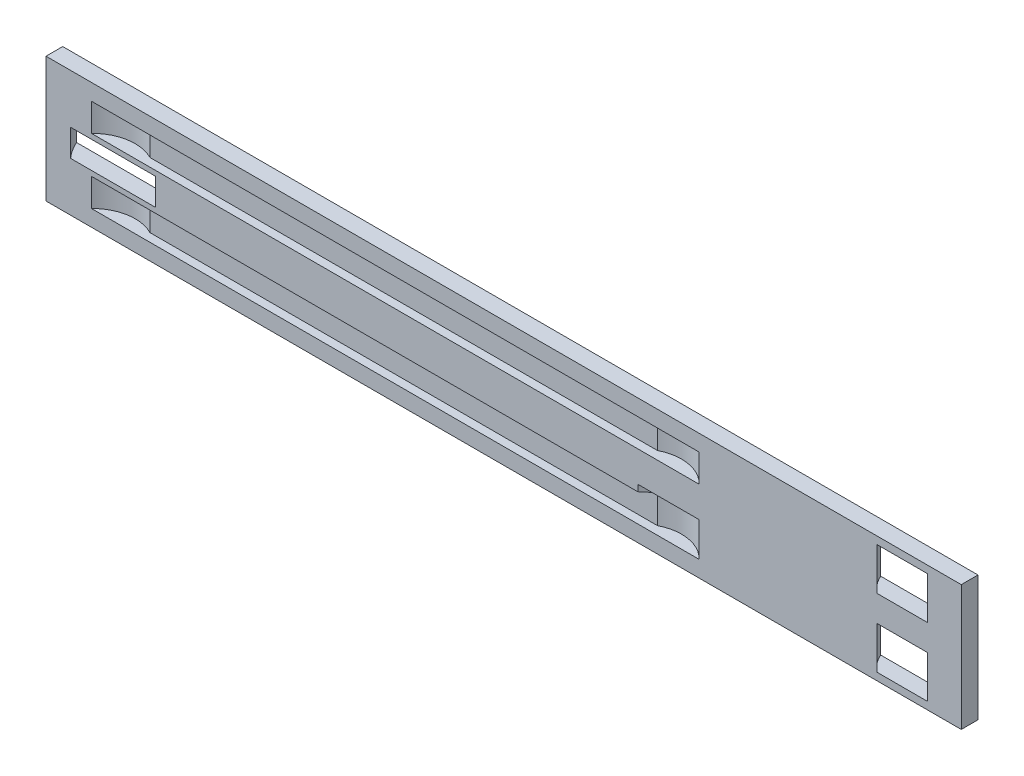
ISO-10303-21;
HEADER;
FILE_DESCRIPTION(('STEP AP214'),'2;1');
FILE_NAME('part.step','',(''),(''),'','','');
FILE_SCHEMA(('AUTOMOTIVE_DESIGN { 1 0 10303 214 1 1 1 1 }'));
ENDSEC;
DATA;
#1=APPLICATION_CONTEXT('core data for automotive mechanical design processes');
#2=APPLICATION_PROTOCOL_DEFINITION('international standard','automotive_design',2000,#1);
#3=PRODUCT_CONTEXT('',#1,'mechanical');
#4=PRODUCT('Part','Part','',(#3));
#5=PRODUCT_RELATED_PRODUCT_CATEGORY('part','',(#4));
#6=PRODUCT_DEFINITION_FORMATION('','',#4);
#7=PRODUCT_DEFINITION_CONTEXT('part definition',#1,'design');
#8=PRODUCT_DEFINITION('design','',#6,#7);
#9=PRODUCT_DEFINITION_SHAPE('','',#8);
#10=(LENGTH_UNIT() NAMED_UNIT(*) SI_UNIT(.MILLI.,.METRE.));
#11=(NAMED_UNIT(*) PLANE_ANGLE_UNIT() SI_UNIT($,.RADIAN.));
#12=(NAMED_UNIT(*) SI_UNIT($,.STERADIAN.) SOLID_ANGLE_UNIT());
#13=UNCERTAINTY_MEASURE_WITH_UNIT(LENGTH_MEASURE(1.E-05),#10,'distance_accuracy_value','');
#14=(GEOMETRIC_REPRESENTATION_CONTEXT(3) GLOBAL_UNCERTAINTY_ASSIGNED_CONTEXT((#13)) GLOBAL_UNIT_ASSIGNED_CONTEXT((#10,
#11,#12)) REPRESENTATION_CONTEXT('',''));
#15=CARTESIAN_POINT('',(0.,0.,0.));
#16=DIRECTION('',(0.,0.,1.));
#17=DIRECTION('',(1.,0.,0.));
#18=AXIS2_PLACEMENT_3D('',#15,#16,#17);
#19=CARTESIAN_POINT('',(0.,0.,18.));
#20=DIRECTION('',(0.,0.,-1.));
#21=DIRECTION('',(-1.,0.,0.));
#22=AXIS2_PLACEMENT_3D('',#19,#20,#21);
#23=PLANE('',#22);
#24=DIRECTION('',(-1.,0.,0.));
#25=VECTOR('',#24,1.);
#26=CARTESIAN_POINT('',(0.,54.5,18.));
#27=LINE('',#26,#25);
#28=CARTESIAN_POINT('',(702.954576716283,54.5000000000002,18.));
#29=VERTEX_POINT('',#28);
#30=CARTESIAN_POINT('',(636.86373014885,54.5000000000002,18.));
#31=VERTEX_POINT('',#30);
#32=EDGE_CURVE('E11',#29,#31,#27,.T.);
#33=ORIENTED_EDGE('',*,*,#32,.F.);
#34=DIRECTION('',(0.,-1.,0.));
#35=VECTOR('',#34,1.);
#36=CARTESIAN_POINT('',(702.954576716283,47.5000000000002,18.));
#37=LINE('',#36,#35);
#38=CARTESIAN_POINT('',(702.954576716283,17.5000000000002,18.));
#39=VERTEX_POINT('',#38);
#40=EDGE_CURVE('E214',#29,#39,#37,.T.);
#41=ORIENTED_EDGE('',*,*,#40,.T.);
#42=DIRECTION('',(1.,0.,0.));
#43=VECTOR('',#42,1.);
#44=CARTESIAN_POINT('',(48.9545767162834,17.5,18.));
#45=LINE('',#44,#43);
#46=CARTESIAN_POINT('',(48.9545767162834,17.5,18.));
#47=VERTEX_POINT('',#46);
#48=EDGE_CURVE('E227',#47,#39,#45,.T.);
#49=ORIENTED_EDGE('',*,*,#48,.F.);
#50=DIRECTION('',(0.,-1.,0.));
#51=VECTOR('',#50,1.);
#52=CARTESIAN_POINT('',(48.9545767162834,47.5,18.));
#53=LINE('',#52,#51);
#54=CARTESIAN_POINT('',(48.9545767162834,47.5,18.));
#55=VERTEX_POINT('',#54);
#56=EDGE_CURVE('E63',#55,#47,#53,.T.);
#57=ORIENTED_EDGE('',*,*,#56,.F.);
#58=DIRECTION('',(1.,0.,0.));
#59=VECTOR('',#58,1.);
#60=CARTESIAN_POINT('',(48.9545767162834,47.5,18.));
#61=LINE('',#60,#59);
#62=CARTESIAN_POINT('',(636.86373014885,47.5000000000002,18.));
#63=VERTEX_POINT('',#62);
#64=EDGE_CURVE('E221',#55,#63,#61,.T.);
#65=ORIENTED_EDGE('',*,*,#64,.T.);
#66=DIRECTION('',(0.,-1.,0.));
#67=VECTOR('',#66,1.);
#68=CARTESIAN_POINT('',(636.86373014885,54.5000000000002,18.));
#69=LINE('',#68,#67);
#70=EDGE_CURVE('E55',#63,#31,#69,.F.);
#71=ORIENTED_EDGE('',*,*,#70,.T.);
#72=EDGE_LOOP('',(#33,#41,#49,#57,#65,#71));
#73=FACE_BOUND('',#72,.T.);
#74=DIRECTION('',(0.,1.,0.));
#75=VECTOR('',#74,1.);
#76=CARTESIAN_POINT('',(702.954576716283,87.5000000000002,18.));
#77=LINE('',#76,#75);
#78=CARTESIAN_POINT('',(702.954576716283,87.5000000000002,18.));
#79=VERTEX_POINT('',#78);
#80=CARTESIAN_POINT('',(702.954576716283,117.5,18.));
#81=VERTEX_POINT('',#80);
#82=EDGE_CURVE('E291',#79,#81,#77,.T.);
#83=ORIENTED_EDGE('',*,*,#82,.F.);
#84=DIRECTION('',(1.,0.,0.));
#85=VECTOR('',#84,1.);
#86=CARTESIAN_POINT('',(48.9545767162833,87.5,18.));
#87=LINE('',#86,#85);
#88=CARTESIAN_POINT('',(48.9545767162833,87.5,18.));
#89=VERTEX_POINT('',#88);
#90=EDGE_CURVE('E273',#89,#79,#87,.T.);
#91=ORIENTED_EDGE('',*,*,#90,.F.);
#92=DIRECTION('',(0.,1.,0.));
#93=VECTOR('',#92,1.);
#94=CARTESIAN_POINT('',(48.9545767162833,87.5,18.));
#95=LINE('',#94,#93);
#96=CARTESIAN_POINT('',(48.9545767162833,117.5,18.));
#97=VERTEX_POINT('',#96);
#98=EDGE_CURVE('E296',#89,#97,#95,.T.);
#99=ORIENTED_EDGE('',*,*,#98,.T.);
#100=DIRECTION('',(1.,0.,0.));
#101=VECTOR('',#100,1.);
#102=CARTESIAN_POINT('',(48.9545767162833,117.5,18.));
#103=LINE('',#102,#101);
#104=EDGE_CURVE('E265',#97,#81,#103,.T.);
#105=ORIENTED_EDGE('',*,*,#104,.T.);
#106=EDGE_LOOP('',(#83,#91,#99,#105));
#107=FACE_BOUND('',#106,.T.);
#108=DIRECTION('',(1.,0.,0.));
#109=VECTOR('',#108,1.);
#110=CARTESIAN_POINT('',(0.,81.5,18.));
#111=LINE('',#110,#109);
#112=CARTESIAN_POINT('',(894.5,81.5000000000004,18.));
#113=VERTEX_POINT('',#112);
#114=CARTESIAN_POINT('',(948.5,81.5000000000004,18.));
#115=VERTEX_POINT('',#114);
#116=EDGE_CURVE('E342',#113,#115,#111,.T.);
#117=ORIENTED_EDGE('',*,*,#116,.F.);
#118=DIRECTION('',(0.,1.,0.));
#119=VECTOR('',#118,1.);
#120=CARTESIAN_POINT('',(894.5,81.5000000000004,18.));
#121=LINE('',#120,#119);
#122=CARTESIAN_POINT('',(894.5,127.,18.));
#123=VERTEX_POINT('',#122);
#124=EDGE_CURVE('E349',#123,#113,#121,.F.);
#125=ORIENTED_EDGE('',*,*,#124,.F.);
#126=DIRECTION('',(1.,0.,0.));
#127=VECTOR('',#126,1.);
#128=CARTESIAN_POINT('',(0.,127.,18.));
#129=LINE('',#128,#127);
#130=CARTESIAN_POINT('',(948.5,127.,18.));
#131=VERTEX_POINT('',#130);
#132=EDGE_CURVE('E334',#123,#131,#129,.T.);
#133=ORIENTED_EDGE('',*,*,#132,.T.);
#134=DIRECTION('',(0.,1.,0.));
#135=VECTOR('',#134,1.);
#136=CARTESIAN_POINT('',(948.5,81.5000000000004,18.));
#137=LINE('',#136,#135);
#138=EDGE_CURVE('E345',#115,#131,#137,.T.);
#139=ORIENTED_EDGE('',*,*,#138,.F.);
#140=EDGE_LOOP('',(#117,#125,#133,#139));
#141=FACE_BOUND('',#140,.T.);
#142=DIRECTION('',(1.,0.,0.));
#143=VECTOR('',#142,1.);
#144=CARTESIAN_POINT('',(985.,0.,18.));
#145=LINE('',#144,#143);
#146=CARTESIAN_POINT('',(0.,0.,18.));
#147=VERTEX_POINT('',#146);
#148=CARTESIAN_POINT('',(985.,0.,18.));
#149=VERTEX_POINT('',#148);
#150=EDGE_CURVE('E378',#147,#149,#145,.T.);
#151=ORIENTED_EDGE('',*,*,#150,.T.);
#152=DIRECTION('',(0.,1.,0.));
#153=VECTOR('',#152,1.);
#154=CARTESIAN_POINT('',(985.,135.,18.));
#155=LINE('',#154,#153);
#156=CARTESIAN_POINT('',(985.,135.,18.));
#157=VERTEX_POINT('',#156);
#158=EDGE_CURVE('E382',#149,#157,#155,.T.);
#159=ORIENTED_EDGE('',*,*,#158,.T.);
#160=DIRECTION('',(-1.,0.,0.));
#161=VECTOR('',#160,1.);
#162=CARTESIAN_POINT('',(0.,135.,18.));
#163=LINE('',#162,#161);
#164=CARTESIAN_POINT('',(0.,135.,18.));
#165=VERTEX_POINT('',#164);
#166=EDGE_CURVE('E386',#157,#165,#163,.T.);
#167=ORIENTED_EDGE('',*,*,#166,.T.);
#168=DIRECTION('',(0.,-1.,0.));
#169=VECTOR('',#168,1.);
#170=CARTESIAN_POINT('',(0.,0.,18.));
#171=LINE('',#170,#169);
#172=EDGE_CURVE('E389',#165,#147,#171,.T.);
#173=ORIENTED_EDGE('',*,*,#172,.T.);
#174=EDGE_LOOP('',(#151,#159,#167,#173));
#175=FACE_BOUND('',#174,.T.);
#176=DIRECTION('',(-1.,0.,0.));
#177=VECTOR('',#176,1.);
#178=CARTESIAN_POINT('',(0.,53.5,18.));
#179=LINE('',#178,#177);
#180=CARTESIAN_POINT('',(948.5,53.5000000000001,18.));
#181=VERTEX_POINT('',#180);
#182=CARTESIAN_POINT('',(894.5,53.5000000000001,18.));
#183=VERTEX_POINT('',#182);
#184=EDGE_CURVE('E366',#181,#183,#179,.T.);
#185=ORIENTED_EDGE('',*,*,#184,.F.);
#186=DIRECTION('',(0.,-1.,0.));
#187=VECTOR('',#186,1.);
#188=CARTESIAN_POINT('',(948.5,53.5000000000001,18.));
#189=LINE('',#188,#187);
#190=CARTESIAN_POINT('',(948.5,8.00000000000008,18.));
#191=VERTEX_POINT('',#190);
#192=EDGE_CURVE('E373',#181,#191,#189,.T.);
#193=ORIENTED_EDGE('',*,*,#192,.T.);
#194=DIRECTION('',(-1.,0.,0.));
#195=VECTOR('',#194,1.);
#196=CARTESIAN_POINT('',(0.,8.,18.));
#197=LINE('',#196,#195);
#198=CARTESIAN_POINT('',(894.5,8.00000000000008,18.));
#199=VERTEX_POINT('',#198);
#200=EDGE_CURVE('E357',#191,#199,#197,.T.);
#201=ORIENTED_EDGE('',*,*,#200,.T.);
#202=DIRECTION('',(0.,-1.,0.));
#203=VECTOR('',#202,1.);
#204=CARTESIAN_POINT('',(894.5,53.5000000000001,18.));
#205=LINE('',#204,#203);
#206=EDGE_CURVE('E369',#199,#183,#205,.F.);
#207=ORIENTED_EDGE('',*,*,#206,.T.);
#208=EDGE_LOOP('',(#185,#193,#201,#207));
#209=FACE_BOUND('',#208,.T.);
#210=DIRECTION('',(1.,0.,0.));
#211=VECTOR('',#210,1.);
#212=CARTESIAN_POINT('',(0.,53.,18.));
#213=LINE('',#212,#211);
#214=CARTESIAN_POINT('',(26.5053613648166,53.,18.));
#215=VERTEX_POINT('',#214);
#216=CARTESIAN_POINT('',(117.894638635183,53.,18.));
#217=VERTEX_POINT('',#216);
#218=EDGE_CURVE('E318',#215,#217,#213,.T.);
#219=ORIENTED_EDGE('',*,*,#218,.F.);
#220=DIRECTION('',(0.,1.,0.));
#221=VECTOR('',#220,1.);
#222=CARTESIAN_POINT('',(26.5053613648166,53.,18.));
#223=LINE('',#222,#221);
#224=CARTESIAN_POINT('',(26.5053613648166,82.,18.));
#225=VERTEX_POINT('',#224);
#226=EDGE_CURVE('E325',#215,#225,#223,.T.);
#227=ORIENTED_EDGE('',*,*,#226,.T.);
#228=DIRECTION('',(1.,0.,0.));
#229=VECTOR('',#228,1.);
#230=CARTESIAN_POINT('',(0.,82.,18.));
#231=LINE('',#230,#229);
#232=CARTESIAN_POINT('',(117.894638635183,82.,18.));
#233=VERTEX_POINT('',#232);
#234=EDGE_CURVE('E309',#225,#233,#231,.T.);
#235=ORIENTED_EDGE('',*,*,#234,.T.);
#236=DIRECTION('',(0.,1.,0.));
#237=VECTOR('',#236,1.);
#238=CARTESIAN_POINT('',(117.894638635183,53.,18.));
#239=LINE('',#238,#237);
#240=EDGE_CURVE('E321',#233,#217,#239,.F.);
#241=ORIENTED_EDGE('',*,*,#240,.T.);
#242=EDGE_LOOP('',(#219,#227,#235,#241));
#243=FACE_BOUND('',#242,.T.);
#244=ADVANCED_FACE('F39',(#73,#107,#141,#175,#209,#243),#23,.F.);
#245=CARTESIAN_POINT('',(0.,0.,0.));
#246=DIRECTION('',(0.,0.,-1.));
#247=DIRECTION('',(-1.,0.,0.));
#248=AXIS2_PLACEMENT_3D('',#245,#246,#247);
#249=PLANE('',#248);
#250=DIRECTION('',(1.,0.,0.));
#251=VECTOR('',#250,1.);
#252=CARTESIAN_POINT('',(985.,0.,0.));
#253=LINE('',#252,#251);
#254=CARTESIAN_POINT('',(0.,0.,0.));
#255=VERTEX_POINT('',#254);
#256=CARTESIAN_POINT('',(985.,0.,0.));
#257=VERTEX_POINT('',#256);
#258=EDGE_CURVE('E377',#255,#257,#253,.T.);
#259=ORIENTED_EDGE('',*,*,#258,.F.);
#260=DIRECTION('',(0.,-1.,0.));
#261=VECTOR('',#260,1.);
#262=CARTESIAN_POINT('',(0.,0.,0.));
#263=LINE('',#262,#261);
#264=CARTESIAN_POINT('',(0.,135.,0.));
#265=VERTEX_POINT('',#264);
#266=EDGE_CURVE('E383',#265,#255,#263,.T.);
#267=ORIENTED_EDGE('',*,*,#266,.F.);
#268=DIRECTION('',(-1.,0.,0.));
#269=VECTOR('',#268,1.);
#270=CARTESIAN_POINT('',(0.,135.,0.));
#271=LINE('',#270,#269);
#272=CARTESIAN_POINT('',(985.,135.,0.));
#273=VERTEX_POINT('',#272);
#274=EDGE_CURVE('E399',#273,#265,#271,.T.);
#275=ORIENTED_EDGE('',*,*,#274,.F.);
#276=DIRECTION('',(0.,1.,0.));
#277=VECTOR('',#276,1.);
#278=CARTESIAN_POINT('',(985.,135.,0.));
#279=LINE('',#278,#277);
#280=EDGE_CURVE('E396',#257,#273,#279,.T.);
#281=ORIENTED_EDGE('',*,*,#280,.F.);
#282=EDGE_LOOP('',(#259,#267,#275,#281));
#283=FACE_BOUND('',#282,.T.);
#284=DIRECTION('',(0.,-1.,0.));
#285=VECTOR('',#284,1.);
#286=CARTESIAN_POINT('',(962.743181254603,53.5000000000001,0.));
#287=LINE('',#286,#285);
#288=CARTESIAN_POINT('',(962.743181254603,53.5000000000001,0.));
#289=VERTEX_POINT('',#288);
#290=CARTESIAN_POINT('',(962.743181254603,8.00000000000009,0.));
#291=VERTEX_POINT('',#290);
#292=EDGE_CURVE('E425',#289,#291,#287,.T.);
#293=ORIENTED_EDGE('',*,*,#292,.F.);
#294=DIRECTION('',(-1.,0.,0.));
#295=VECTOR('',#294,1.);
#296=CARTESIAN_POINT('',(0.,53.5,0.));
#297=LINE('',#296,#295);
#298=CARTESIAN_POINT('',(880.256818745397,53.5000000000001,0.));
#299=VERTEX_POINT('',#298);
#300=EDGE_CURVE('E429',#289,#299,#297,.T.);
#301=ORIENTED_EDGE('',*,*,#300,.T.);
#302=DIRECTION('',(0.,-1.,0.));
#303=VECTOR('',#302,1.);
#304=CARTESIAN_POINT('',(880.256818745397,53.5000000000001,0.));
#305=LINE('',#304,#303);
#306=CARTESIAN_POINT('',(880.256818745397,8.00000000000008,0.));
#307=VERTEX_POINT('',#306);
#308=EDGE_CURVE('E422',#307,#299,#305,.F.);
#309=ORIENTED_EDGE('',*,*,#308,.F.);
#310=DIRECTION('',(-1.,0.,0.));
#311=VECTOR('',#310,1.);
#312=CARTESIAN_POINT('',(0.,8.,0.));
#313=LINE('',#312,#311);
#314=EDGE_CURVE('E419',#291,#307,#313,.T.);
#315=ORIENTED_EDGE('',*,*,#314,.F.);
#316=EDGE_LOOP('',(#293,#301,#309,#315));
#317=FACE_BOUND('',#316,.T.);
#318=DIRECTION('',(0.,1.,0.));
#319=VECTOR('',#318,1.);
#320=CARTESIAN_POINT('',(880.256818745397,81.5000000000004,0.));
#321=LINE('',#320,#319);
#322=CARTESIAN_POINT('',(880.256818745397,127.,0.));
#323=VERTEX_POINT('',#322);
#324=CARTESIAN_POINT('',(880.256818745397,81.5000000000004,0.));
#325=VERTEX_POINT('',#324);
#326=EDGE_CURVE('E440',#323,#325,#321,.F.);
#327=ORIENTED_EDGE('',*,*,#326,.T.);
#328=DIRECTION('',(1.,0.,0.));
#329=VECTOR('',#328,1.);
#330=CARTESIAN_POINT('',(0.,81.5,0.));
#331=LINE('',#330,#329);
#332=CARTESIAN_POINT('',(962.743181254603,81.5000000000004,0.));
#333=VERTEX_POINT('',#332);
#334=EDGE_CURVE('E444',#325,#333,#331,.T.);
#335=ORIENTED_EDGE('',*,*,#334,.T.);
#336=DIRECTION('',(0.,1.,0.));
#337=VECTOR('',#336,1.);
#338=CARTESIAN_POINT('',(962.743181254603,81.5000000000004,0.));
#339=LINE('',#338,#337);
#340=CARTESIAN_POINT('',(962.743181254603,127.,0.));
#341=VERTEX_POINT('',#340);
#342=EDGE_CURVE('E436',#333,#341,#339,.T.);
#343=ORIENTED_EDGE('',*,*,#342,.T.);
#344=DIRECTION('',(1.,0.,0.));
#345=VECTOR('',#344,1.);
#346=CARTESIAN_POINT('',(0.,127.,0.));
#347=LINE('',#346,#345);
#348=EDGE_CURVE('E433',#323,#341,#347,.T.);
#349=ORIENTED_EDGE('',*,*,#348,.F.);
#350=EDGE_LOOP('',(#327,#335,#343,#349));
#351=FACE_BOUND('',#350,.T.);
#352=DIRECTION('',(0.,1.,0.));
#353=VECTOR('',#352,1.);
#354=CARTESIAN_POINT('',(14.9007853456961,53.,0.));
#355=LINE('',#354,#353);
#356=CARTESIAN_POINT('',(14.9007853456961,53.,0.));
#357=VERTEX_POINT('',#356);
#358=CARTESIAN_POINT('',(14.9007853456961,82.,0.));
#359=VERTEX_POINT('',#358);
#360=EDGE_CURVE('E454',#357,#359,#355,.T.);
#361=ORIENTED_EDGE('',*,*,#360,.F.);
#362=DIRECTION('',(1.,0.,0.));
#363=VECTOR('',#362,1.);
#364=CARTESIAN_POINT('',(0.,53.,0.));
#365=LINE('',#364,#363);
#366=CARTESIAN_POINT('',(129.499214654304,53.,0.));
#367=VERTEX_POINT('',#366);
#368=EDGE_CURVE('E48',#357,#367,#365,.T.);
#369=ORIENTED_EDGE('',*,*,#368,.T.);
#370=DIRECTION('',(0.,1.,0.));
#371=VECTOR('',#370,1.);
#372=CARTESIAN_POINT('',(129.499214654304,53.,0.));
#373=LINE('',#372,#371);
#374=CARTESIAN_POINT('',(129.499214654304,82.,0.));
#375=VERTEX_POINT('',#374);
#376=EDGE_CURVE('E451',#375,#367,#373,.F.);
#377=ORIENTED_EDGE('',*,*,#376,.F.);
#378=DIRECTION('',(1.,0.,0.));
#379=VECTOR('',#378,1.);
#380=CARTESIAN_POINT('',(0.,82.,0.));
#381=LINE('',#380,#379);
#382=EDGE_CURVE('E448',#359,#375,#381,.T.);
#383=ORIENTED_EDGE('',*,*,#382,.F.);
#384=EDGE_LOOP('',(#361,#369,#377,#383));
#385=FACE_BOUND('',#384,.T.);
#386=ADVANCED_FACE('F462',(#283,#317,#351,#385),#249,.T.);
#387=CARTESIAN_POINT('',(985.,0.,18.));
#388=DIRECTION('',(0.,1.,0.));
#389=DIRECTION('',(-1.,0.,0.));
#390=AXIS2_PLACEMENT_3D('',#387,#388,#389);
#391=PLANE('',#390);
#392=ORIENTED_EDGE('',*,*,#258,.T.);
#393=DIRECTION('',(0.,0.,-1.));
#394=VECTOR('',#393,1.);
#395=CARTESIAN_POINT('',(985.,0.,18.));
#396=LINE('',#395,#394);
#397=EDGE_CURVE('E415',#149,#257,#396,.T.);
#398=ORIENTED_EDGE('',*,*,#397,.F.);
#399=ORIENTED_EDGE('',*,*,#150,.F.);
#400=DIRECTION('',(0.,0.,-1.));
#401=VECTOR('',#400,1.);
#402=CARTESIAN_POINT('',(0.,0.,18.));
#403=LINE('',#402,#401);
#404=EDGE_CURVE('E392',#147,#255,#403,.T.);
#405=ORIENTED_EDGE('',*,*,#404,.T.);
#406=EDGE_LOOP('',(#392,#398,#399,#405));
#407=FACE_BOUND('',#406,.T.);
#408=ADVANCED_FACE('F41',(#407),#391,.F.);
#409=CARTESIAN_POINT('',(985.,135.,18.));
#410=DIRECTION('',(-1.,0.,0.));
#411=DIRECTION('',(0.,0.,1.));
#412=AXIS2_PLACEMENT_3D('',#409,#410,#411);
#413=PLANE('',#412);
#414=ORIENTED_EDGE('',*,*,#280,.T.);
#415=DIRECTION('',(0.,0.,-1.));
#416=VECTOR('',#415,1.);
#417=CARTESIAN_POINT('',(985.,135.,18.));
#418=LINE('',#417,#416);
#419=EDGE_CURVE('E411',#157,#273,#418,.T.);
#420=ORIENTED_EDGE('',*,*,#419,.F.);
#421=ORIENTED_EDGE('',*,*,#158,.F.);
#422=ORIENTED_EDGE('',*,*,#397,.T.);
#423=EDGE_LOOP('',(#414,#420,#421,#422));
#424=FACE_BOUND('',#423,.T.);
#425=ADVANCED_FACE('F510',(#424),#413,.F.);
#426=CARTESIAN_POINT('',(0.,135.,18.));
#427=DIRECTION('',(0.,-1.,0.));
#428=DIRECTION('',(1.,0.,0.));
#429=AXIS2_PLACEMENT_3D('',#426,#427,#428);
#430=PLANE('',#429);
#431=ORIENTED_EDGE('',*,*,#274,.T.);
#432=DIRECTION('',(0.,0.,-1.));
#433=VECTOR('',#432,1.);
#434=CARTESIAN_POINT('',(0.,135.,18.));
#435=LINE('',#434,#433);
#436=EDGE_CURVE('E407',#165,#265,#435,.T.);
#437=ORIENTED_EDGE('',*,*,#436,.F.);
#438=ORIENTED_EDGE('',*,*,#166,.F.);
#439=ORIENTED_EDGE('',*,*,#419,.T.);
#440=EDGE_LOOP('',(#431,#437,#438,#439));
#441=FACE_BOUND('',#440,.T.);
#442=ADVANCED_FACE('F507',(#441),#430,.F.);
#443=CARTESIAN_POINT('',(0.,0.,18.));
#444=DIRECTION('',(1.,0.,0.));
#445=DIRECTION('',(0.,0.,-1.));
#446=AXIS2_PLACEMENT_3D('',#443,#444,#445);
#447=PLANE('',#446);
#448=ORIENTED_EDGE('',*,*,#266,.T.);
#449=ORIENTED_EDGE('',*,*,#404,.F.);
#450=ORIENTED_EDGE('',*,*,#172,.F.);
#451=ORIENTED_EDGE('',*,*,#436,.T.);
#452=EDGE_LOOP('',(#448,#449,#450,#451));
#453=FACE_BOUND('',#452,.T.);
#454=ADVANCED_FACE('F504',(#453),#447,.F.);
#455=CARTESIAN_POINT('',(921.5,53.5000000000001,-18.));
#456=DIRECTION('',(0.,-1.,0.));
#457=DIRECTION('',(1.,0.,0.));
#458=AXIS2_PLACEMENT_3D('',#455,#456,#457);
#459=CYLINDRICAL_SURFACE('',#458,45.0000000000001);
#460=CARTESIAN_POINT('',(921.5,53.5000000000001,-18.));
#461=DIRECTION('',(0.,-1.,0.));
#462=DIRECTION('',(1.,0.,0.));
#463=AXIS2_PLACEMENT_3D('',#460,#461,#462);
#464=CIRCLE('',#463,45.0000000000001);
#465=EDGE_CURVE('E353',#289,#181,#464,.T.);
#466=ORIENTED_EDGE('',*,*,#465,.F.);
#467=ORIENTED_EDGE('',*,*,#292,.T.);
#468=CARTESIAN_POINT('',(921.5,8.00000000000008,-18.));
#469=DIRECTION('',(0.,-1.,0.));
#470=DIRECTION('',(1.,0.,0.));
#471=AXIS2_PLACEMENT_3D('',#468,#469,#470);
#472=CIRCLE('',#471,45.0000000000001);
#473=EDGE_CURVE('E359',#291,#191,#472,.T.);
#474=ORIENTED_EDGE('',*,*,#473,.T.);
#475=ORIENTED_EDGE('',*,*,#192,.F.);
#476=EDGE_LOOP('',(#466,#467,#474,#475));
#477=FACE_BOUND('',#476,.T.);
#478=ADVANCED_FACE('F501',(#477),#459,.F.);
#479=EDGE_CURVE('E352',#199,#307,#472,.T.);
#480=ORIENTED_EDGE('',*,*,#479,.T.);
#481=ORIENTED_EDGE('',*,*,#308,.T.);
#482=EDGE_CURVE('E358',#183,#299,#464,.T.);
#483=ORIENTED_EDGE('',*,*,#482,.F.);
#484=ORIENTED_EDGE('',*,*,#206,.F.);
#485=EDGE_LOOP('',(#480,#481,#483,#484));
#486=FACE_BOUND('',#485,.T.);
#487=ADVANCED_FACE('F540',(#486),#459,.F.);
#488=CARTESIAN_POINT('',(921.5,53.5000000000001,-18.));
#489=DIRECTION('',(0.,-1.,0.));
#490=DIRECTION('',(1.,0.,0.));
#491=AXIS2_PLACEMENT_3D('',#488,#489,#490);
#492=PLANE('',#491);
#493=ORIENTED_EDGE('',*,*,#184,.T.);
#494=ORIENTED_EDGE('',*,*,#482,.T.);
#495=ORIENTED_EDGE('',*,*,#300,.F.);
#496=ORIENTED_EDGE('',*,*,#465,.T.);
#497=EDGE_LOOP('',(#493,#494,#495,#496));
#498=FACE_BOUND('',#497,.T.);
#499=ADVANCED_FACE('F536',(#498),#492,.T.);
#500=CARTESIAN_POINT('',(921.5,8.00000000000008,-18.));
#501=DIRECTION('',(0.,-1.,0.));
#502=DIRECTION('',(1.,0.,0.));
#503=AXIS2_PLACEMENT_3D('',#500,#501,#502);
#504=PLANE('',#503);
#505=ORIENTED_EDGE('',*,*,#473,.F.);
#506=ORIENTED_EDGE('',*,*,#314,.T.);
#507=ORIENTED_EDGE('',*,*,#479,.F.);
#508=ORIENTED_EDGE('',*,*,#200,.F.);
#509=EDGE_LOOP('',(#505,#506,#507,#508));
#510=FACE_BOUND('',#509,.T.);
#511=ADVANCED_FACE('F576',(#510),#504,.F.);
#512=CARTESIAN_POINT('',(921.5,81.5000000000004,-18.));
#513=DIRECTION('',(0.,1.,0.));
#514=DIRECTION('',(-1.,0.,0.));
#515=AXIS2_PLACEMENT_3D('',#512,#513,#514);
#516=CYLINDRICAL_SURFACE('',#515,45.0000000000001);
#517=ORIENTED_EDGE('',*,*,#124,.T.);
#518=CARTESIAN_POINT('',(921.5,81.5000000000004,-18.));
#519=DIRECTION('',(0.,-1.,0.));
#520=DIRECTION('',(1.,0.,0.));
#521=AXIS2_PLACEMENT_3D('',#518,#519,#520);
#522=CIRCLE('',#521,45.0000000000001);
#523=EDGE_CURVE('E335',#113,#325,#522,.T.);
#524=ORIENTED_EDGE('',*,*,#523,.T.);
#525=ORIENTED_EDGE('',*,*,#326,.F.);
#526=CARTESIAN_POINT('',(921.5,127.,-18.));
#527=DIRECTION('',(0.,-1.,0.));
#528=DIRECTION('',(1.,0.,0.));
#529=AXIS2_PLACEMENT_3D('',#526,#527,#528);
#530=CIRCLE('',#529,45.0000000000001);
#531=EDGE_CURVE('E329',#123,#323,#530,.T.);
#532=ORIENTED_EDGE('',*,*,#531,.F.);
#533=EDGE_LOOP('',(#517,#524,#525,#532));
#534=FACE_BOUND('',#533,.T.);
#535=ADVANCED_FACE('F555',(#534),#516,.F.);
#536=ORIENTED_EDGE('',*,*,#138,.T.);
#537=EDGE_CURVE('E336',#341,#131,#530,.T.);
#538=ORIENTED_EDGE('',*,*,#537,.F.);
#539=ORIENTED_EDGE('',*,*,#342,.F.);
#540=EDGE_CURVE('E330',#333,#115,#522,.T.);
#541=ORIENTED_EDGE('',*,*,#540,.T.);
#542=EDGE_LOOP('',(#536,#538,#539,#541));
#543=FACE_BOUND('',#542,.T.);
#544=ADVANCED_FACE('F560',(#543),#516,.F.);
#545=CARTESIAN_POINT('',(921.5,81.5000000000004,-18.));
#546=DIRECTION('',(0.,1.,0.));
#547=DIRECTION('',(1.,0.,0.));
#548=AXIS2_PLACEMENT_3D('',#545,#546,#547);
#549=PLANE('',#548);
#550=ORIENTED_EDGE('',*,*,#116,.T.);
#551=ORIENTED_EDGE('',*,*,#540,.F.);
#552=ORIENTED_EDGE('',*,*,#334,.F.);
#553=ORIENTED_EDGE('',*,*,#523,.F.);
#554=EDGE_LOOP('',(#550,#551,#552,#553));
#555=FACE_BOUND('',#554,.T.);
#556=ADVANCED_FACE('F563',(#555),#549,.T.);
#557=CARTESIAN_POINT('',(921.5,127.,-18.));
#558=DIRECTION('',(0.,1.,0.));
#559=DIRECTION('',(1.,0.,0.));
#560=AXIS2_PLACEMENT_3D('',#557,#558,#559);
#561=PLANE('',#560);
#562=ORIENTED_EDGE('',*,*,#531,.T.);
#563=ORIENTED_EDGE('',*,*,#348,.T.);
#564=ORIENTED_EDGE('',*,*,#537,.T.);
#565=ORIENTED_EDGE('',*,*,#132,.F.);
#566=EDGE_LOOP('',(#562,#563,#564,#565));
#567=FACE_BOUND('',#566,.T.);
#568=ADVANCED_FACE('F550',(#567),#561,.F.);
#569=CARTESIAN_POINT('',(72.2,53.,-24.2));
#570=DIRECTION('',(0.,1.,0.));
#571=DIRECTION('',(-1.,0.,0.));
#572=AXIS2_PLACEMENT_3D('',#569,#570,#571);
#573=CYLINDRICAL_SURFACE('',#572,62.2);
#574=CARTESIAN_POINT('',(72.2,53.,-24.2));
#575=DIRECTION('',(0.,1.,0.));
#576=DIRECTION('',(-1.,0.,0.));
#577=AXIS2_PLACEMENT_3D('',#574,#575,#576);
#578=CIRCLE('',#577,62.2);
#579=EDGE_CURVE('E305',#357,#215,#578,.T.);
#580=ORIENTED_EDGE('',*,*,#579,.F.);
#581=ORIENTED_EDGE('',*,*,#360,.T.);
#582=CARTESIAN_POINT('',(72.2,82.,-24.2));
#583=DIRECTION('',(0.,1.,0.));
#584=DIRECTION('',(-1.,0.,0.));
#585=AXIS2_PLACEMENT_3D('',#582,#583,#584);
#586=CIRCLE('',#585,62.2);
#587=EDGE_CURVE('E311',#359,#225,#586,.T.);
#588=ORIENTED_EDGE('',*,*,#587,.T.);
#589=ORIENTED_EDGE('',*,*,#226,.F.);
#590=EDGE_LOOP('',(#580,#581,#588,#589));
#591=FACE_BOUND('',#590,.T.);
#592=ADVANCED_FACE('F471',(#591),#573,.F.);
#593=EDGE_CURVE('E295',#233,#375,#586,.T.);
#594=ORIENTED_EDGE('',*,*,#593,.T.);
#595=ORIENTED_EDGE('',*,*,#376,.T.);
#596=EDGE_CURVE('E310',#217,#367,#578,.T.);
#597=ORIENTED_EDGE('',*,*,#596,.F.);
#598=ORIENTED_EDGE('',*,*,#240,.F.);
#599=EDGE_LOOP('',(#594,#595,#597,#598));
#600=FACE_BOUND('',#599,.T.);
#601=ADVANCED_FACE('F476',(#600),#573,.F.);
#602=CARTESIAN_POINT('',(72.2,53.,-24.2));
#603=DIRECTION('',(0.,1.,0.));
#604=DIRECTION('',(-1.,0.,0.));
#605=AXIS2_PLACEMENT_3D('',#602,#603,#604);
#606=PLANE('',#605);
#607=ORIENTED_EDGE('',*,*,#218,.T.);
#608=ORIENTED_EDGE('',*,*,#596,.T.);
#609=ORIENTED_EDGE('',*,*,#368,.F.);
#610=ORIENTED_EDGE('',*,*,#579,.T.);
#611=EDGE_LOOP('',(#607,#608,#609,#610));
#612=FACE_BOUND('',#611,.T.);
#613=ADVANCED_FACE('F467',(#612),#606,.T.);
#614=CARTESIAN_POINT('',(72.2,82.,-24.2));
#615=DIRECTION('',(0.,1.,0.));
#616=DIRECTION('',(-1.,0.,0.));
#617=AXIS2_PLACEMENT_3D('',#614,#615,#616);
#618=PLANE('',#617);
#619=ORIENTED_EDGE('',*,*,#587,.F.);
#620=ORIENTED_EDGE('',*,*,#382,.T.);
#621=ORIENTED_EDGE('',*,*,#593,.F.);
#622=ORIENTED_EDGE('',*,*,#234,.F.);
#623=EDGE_LOOP('',(#619,#620,#621,#622));
#624=FACE_BOUND('',#623,.T.);
#625=ADVANCED_FACE('F480',(#624),#618,.F.);
#626=CARTESIAN_POINT('',(669.909153432567,87.5000000000002,50.));
#627=DIRECTION('',(0.,1.,0.));
#628=DIRECTION('',(-1.,0.,0.));
#629=AXIS2_PLACEMENT_3D('',#626,#627,#628);
#630=CYLINDRICAL_SURFACE('',#629,46.);
#631=CARTESIAN_POINT('',(669.909153432567,117.5,50.));
#632=DIRECTION('',(0.,1.,0.));
#633=DIRECTION('',(1.,0.,0.));
#634=AXIS2_PLACEMENT_3D('',#631,#632,#633);
#635=CIRCLE('',#634,46.);
#636=CARTESIAN_POINT('',(649.052499817953,117.5,9.));
#637=VERTEX_POINT('',#636);
#638=EDGE_CURVE('E251',#81,#637,#635,.T.);
#639=ORIENTED_EDGE('',*,*,#638,.T.);
#640=DIRECTION('',(0.,1.,0.));
#641=VECTOR('',#640,1.);
#642=CARTESIAN_POINT('',(649.052499817953,87.5000000000002,9.));
#643=LINE('',#642,#641);
#644=CARTESIAN_POINT('',(649.052499817953,87.5000000000002,9.));
#645=VERTEX_POINT('',#644);
#646=EDGE_CURVE('E277',#645,#637,#643,.T.);
#647=ORIENTED_EDGE('',*,*,#646,.F.);
#648=CARTESIAN_POINT('',(669.909153432567,87.5000000000002,50.));
#649=DIRECTION('',(0.,1.,0.));
#650=DIRECTION('',(1.,0.,0.));
#651=AXIS2_PLACEMENT_3D('',#648,#649,#650);
#652=CIRCLE('',#651,46.);
#653=EDGE_CURVE('E260',#79,#645,#652,.T.);
#654=ORIENTED_EDGE('',*,*,#653,.F.);
#655=ORIENTED_EDGE('',*,*,#82,.T.);
#656=EDGE_LOOP('',(#639,#647,#654,#655));
#657=FACE_BOUND('',#656,.T.);
#658=ADVANCED_FACE('F482',(#657),#630,.F.);
#659=CARTESIAN_POINT('',(82.,87.5,50.));
#660=DIRECTION('',(0.,1.,0.));
#661=DIRECTION('',(-1.,0.,0.));
#662=AXIS2_PLACEMENT_3D('',#659,#660,#661);
#663=CYLINDRICAL_SURFACE('',#662,46.);
#664=CARTESIAN_POINT('',(82.,117.5,50.));
#665=DIRECTION('',(0.,1.,0.));
#666=DIRECTION('',(-1.,0.,0.));
#667=AXIS2_PLACEMENT_3D('',#664,#665,#666);
#668=CIRCLE('',#667,46.);
#669=CARTESIAN_POINT('',(102.856653614614,117.5,9.));
#670=VERTEX_POINT('',#669);
#671=EDGE_CURVE('E285',#670,#97,#668,.T.);
#672=ORIENTED_EDGE('',*,*,#671,.T.);
#673=ORIENTED_EDGE('',*,*,#98,.F.);
#674=CARTESIAN_POINT('',(82.,87.5,50.));
#675=DIRECTION('',(0.,1.,0.));
#676=DIRECTION('',(-1.,0.,0.));
#677=AXIS2_PLACEMENT_3D('',#674,#675,#676);
#678=CIRCLE('',#677,46.);
#679=CARTESIAN_POINT('',(102.856653614614,87.5,9.));
#680=VERTEX_POINT('',#679);
#681=EDGE_CURVE('E269',#680,#89,#678,.T.);
#682=ORIENTED_EDGE('',*,*,#681,.F.);
#683=DIRECTION('',(0.,1.,0.));
#684=VECTOR('',#683,1.);
#685=CARTESIAN_POINT('',(102.856653614614,87.5,9.));
#686=LINE('',#685,#684);
#687=EDGE_CURVE('E300',#680,#670,#686,.T.);
#688=ORIENTED_EDGE('',*,*,#687,.T.);
#689=EDGE_LOOP('',(#672,#673,#682,#688));
#690=FACE_BOUND('',#689,.T.);
#691=ADVANCED_FACE('F488',(#690),#663,.F.);
#692=CARTESIAN_POINT('',(102.856653614614,87.5,9.));
#693=DIRECTION('',(0.,0.,-1.));
#694=DIRECTION('',(-1.,0.,0.));
#695=AXIS2_PLACEMENT_3D('',#692,#693,#694);
#696=PLANE('',#695);
#697=DIRECTION('',(-1.,0.,0.));
#698=VECTOR('',#697,1.);
#699=CARTESIAN_POINT('',(102.856653614614,117.5,9.));
#700=LINE('',#699,#698);
#701=EDGE_CURVE('E281',#637,#670,#700,.T.);
#702=ORIENTED_EDGE('',*,*,#701,.T.);
#703=ORIENTED_EDGE('',*,*,#687,.F.);
#704=DIRECTION('',(-1.,0.,0.));
#705=VECTOR('',#704,1.);
#706=CARTESIAN_POINT('',(102.856653614614,87.5,9.));
#707=LINE('',#706,#705);
#708=EDGE_CURVE('E264',#645,#680,#707,.T.);
#709=ORIENTED_EDGE('',*,*,#708,.F.);
#710=ORIENTED_EDGE('',*,*,#646,.T.);
#711=EDGE_LOOP('',(#702,#703,#709,#710));
#712=FACE_BOUND('',#711,.T.);
#713=ADVANCED_FACE('F667',(#712),#696,.F.);
#714=CARTESIAN_POINT('',(669.909153432567,87.5000000000002,50.));
#715=DIRECTION('',(0.,-1.,0.));
#716=DIRECTION('',(1.,0.,0.));
#717=AXIS2_PLACEMENT_3D('',#714,#715,#716);
#718=PLANE('',#717);
#719=ORIENTED_EDGE('',*,*,#653,.T.);
#720=ORIENTED_EDGE('',*,*,#708,.T.);
#721=ORIENTED_EDGE('',*,*,#681,.T.);
#722=ORIENTED_EDGE('',*,*,#90,.T.);
#723=EDGE_LOOP('',(#719,#720,#721,#722));
#724=FACE_BOUND('',#723,.T.);
#725=ADVANCED_FACE('F677',(#724),#718,.F.);
#726=CARTESIAN_POINT('',(669.909153432567,117.5,50.));
#727=DIRECTION('',(0.,-1.,0.));
#728=DIRECTION('',(1.,0.,0.));
#729=AXIS2_PLACEMENT_3D('',#726,#727,#728);
#730=PLANE('',#729);
#731=ORIENTED_EDGE('',*,*,#638,.F.);
#732=ORIENTED_EDGE('',*,*,#104,.F.);
#733=ORIENTED_EDGE('',*,*,#671,.F.);
#734=ORIENTED_EDGE('',*,*,#701,.F.);
#735=EDGE_LOOP('',(#731,#732,#733,#734));
#736=FACE_BOUND('',#735,.T.);
#737=ADVANCED_FACE('F687',(#736),#730,.T.);
#738=CARTESIAN_POINT('',(669.909153432567,47.5000000000002,50.));
#739=DIRECTION('',(0.,-1.,0.));
#740=DIRECTION('',(1.,0.,0.));
#741=AXIS2_PLACEMENT_3D('',#738,#739,#740);
#742=CYLINDRICAL_SURFACE('',#741,46.);
#743=CARTESIAN_POINT('',(669.909153432567,17.5000000000002,50.));
#744=DIRECTION('',(0.,1.,0.));
#745=DIRECTION('',(1.,0.,0.));
#746=AXIS2_PLACEMENT_3D('',#743,#744,#745);
#747=CIRCLE('',#746,46.);
#748=CARTESIAN_POINT('',(649.052499817953,17.5000000000002,9.));
#749=VERTEX_POINT('',#748);
#750=EDGE_CURVE('E223',#39,#749,#747,.T.);
#751=ORIENTED_EDGE('',*,*,#750,.F.);
#752=ORIENTED_EDGE('',*,*,#40,.F.);
#753=CARTESIAN_POINT('',(669.909153432567,54.5000000000002,50.));
#754=DIRECTION('',(0.,-1.,0.));
#755=DIRECTION('',(1.,0.,0.));
#756=AXIS2_PLACEMENT_3D('',#753,#754,#755);
#757=CIRCLE('',#756,46.);
#758=EDGE_CURVE('E209',#31,#29,#757,.T.);
#759=ORIENTED_EDGE('',*,*,#758,.F.);
#760=ORIENTED_EDGE('',*,*,#70,.F.);
#761=CARTESIAN_POINT('',(669.909153432567,47.5000000000002,50.));
#762=DIRECTION('',(0.,-1.,0.));
#763=DIRECTION('',(1.,0.,0.));
#764=AXIS2_PLACEMENT_3D('',#761,#762,#763);
#765=CIRCLE('',#764,46.);
#766=CARTESIAN_POINT('',(649.052499817952,47.5000000000002,9.00000000000001));
#767=VERTEX_POINT('',#766);
#768=EDGE_CURVE('E216',#63,#767,#765,.T.);
#769=ORIENTED_EDGE('',*,*,#768,.T.);
#770=DIRECTION('',(0.,-1.,0.));
#771=VECTOR('',#770,1.);
#772=CARTESIAN_POINT('',(649.052499817953,47.5000000000002,9.));
#773=LINE('',#772,#771);
#774=EDGE_CURVE('E247',#767,#749,#773,.T.);
#775=ORIENTED_EDGE('',*,*,#774,.T.);
#776=EDGE_LOOP('',(#751,#752,#759,#760,#769,#775));
#777=FACE_BOUND('',#776,.T.);
#778=ADVANCED_FACE('F213',(#777),#742,.F.);
#779=CARTESIAN_POINT('',(102.856653614614,47.5,9.));
#780=DIRECTION('',(0.,0.,1.));
#781=DIRECTION('',(1.,0.,0.));
#782=AXIS2_PLACEMENT_3D('',#779,#780,#781);
#783=PLANE('',#782);
#784=DIRECTION('',(-1.,0.,0.));
#785=VECTOR('',#784,1.);
#786=CARTESIAN_POINT('',(102.856653614614,17.5,9.));
#787=LINE('',#786,#785);
#788=CARTESIAN_POINT('',(102.856653614614,17.5,9.));
#789=VERTEX_POINT('',#788);
#790=EDGE_CURVE('E234',#749,#789,#787,.T.);
#791=ORIENTED_EDGE('',*,*,#790,.F.);
#792=ORIENTED_EDGE('',*,*,#774,.F.);
#793=DIRECTION('',(-1.,0.,0.));
#794=VECTOR('',#793,1.);
#795=CARTESIAN_POINT('',(102.856653614614,47.5,9.));
#796=LINE('',#795,#794);
#797=CARTESIAN_POINT('',(102.856653614614,47.5,9.));
#798=VERTEX_POINT('',#797);
#799=EDGE_CURVE('E237',#767,#798,#796,.T.);
#800=ORIENTED_EDGE('',*,*,#799,.T.);
#801=DIRECTION('',(0.,-1.,0.));
#802=VECTOR('',#801,1.);
#803=CARTESIAN_POINT('',(102.856653614614,47.5,9.));
#804=LINE('',#803,#802);
#805=EDGE_CURVE('E252',#798,#789,#804,.T.);
#806=ORIENTED_EDGE('',*,*,#805,.T.);
#807=EDGE_LOOP('',(#791,#792,#800,#806));
#808=FACE_BOUND('',#807,.T.);
#809=ADVANCED_FACE('F710',(#808),#783,.T.);
#810=CARTESIAN_POINT('',(82.,47.5,50.));
#811=DIRECTION('',(0.,-1.,0.));
#812=DIRECTION('',(1.,0.,0.));
#813=AXIS2_PLACEMENT_3D('',#810,#811,#812);
#814=CYLINDRICAL_SURFACE('',#813,46.);
#815=CARTESIAN_POINT('',(82.,17.5,50.));
#816=DIRECTION('',(0.,1.,0.));
#817=DIRECTION('',(-1.,0.,0.));
#818=AXIS2_PLACEMENT_3D('',#815,#816,#817);
#819=CIRCLE('',#818,46.);
#820=EDGE_CURVE('E242',#789,#47,#819,.T.);
#821=ORIENTED_EDGE('',*,*,#820,.F.);
#822=ORIENTED_EDGE('',*,*,#805,.F.);
#823=CARTESIAN_POINT('',(82.,47.5,50.));
#824=DIRECTION('',(0.,1.,0.));
#825=DIRECTION('',(-1.,0.,0.));
#826=AXIS2_PLACEMENT_3D('',#823,#824,#825);
#827=CIRCLE('',#826,46.);
#828=EDGE_CURVE('E233',#798,#55,#827,.T.);
#829=ORIENTED_EDGE('',*,*,#828,.T.);
#830=ORIENTED_EDGE('',*,*,#56,.T.);
#831=EDGE_LOOP('',(#821,#822,#829,#830));
#832=FACE_BOUND('',#831,.T.);
#833=ADVANCED_FACE('F704',(#832),#814,.F.);
#834=CARTESIAN_POINT('',(669.909153432567,47.5000000000002,50.));
#835=DIRECTION('',(0.,1.,0.));
#836=DIRECTION('',(1.,0.,0.));
#837=AXIS2_PLACEMENT_3D('',#834,#835,#836);
#838=PLANE('',#837);
#839=ORIENTED_EDGE('',*,*,#799,.F.);
#840=ORIENTED_EDGE('',*,*,#768,.F.);
#841=ORIENTED_EDGE('',*,*,#64,.F.);
#842=ORIENTED_EDGE('',*,*,#828,.F.);
#843=EDGE_LOOP('',(#839,#840,#841,#842));
#844=FACE_BOUND('',#843,.T.);
#845=ADVANCED_FACE('F709',(#844),#838,.F.);
#846=CARTESIAN_POINT('',(669.909153432567,17.5000000000002,50.));
#847=DIRECTION('',(0.,1.,0.));
#848=DIRECTION('',(1.,0.,0.));
#849=AXIS2_PLACEMENT_3D('',#846,#847,#848);
#850=PLANE('',#849);
#851=ORIENTED_EDGE('',*,*,#750,.T.);
#852=ORIENTED_EDGE('',*,*,#790,.T.);
#853=ORIENTED_EDGE('',*,*,#820,.T.);
#854=ORIENTED_EDGE('',*,*,#48,.T.);
#855=EDGE_LOOP('',(#851,#852,#853,#854));
#856=FACE_BOUND('',#855,.T.);
#857=ADVANCED_FACE('F719',(#856),#850,.T.);
#858=CARTESIAN_POINT('',(669.909153432567,54.5000000000002,50.));
#859=DIRECTION('',(0.,-1.,0.));
#860=DIRECTION('',(1.,0.,0.));
#861=AXIS2_PLACEMENT_3D('',#858,#859,#860);
#862=PLANE('',#861);
#863=ORIENTED_EDGE('',*,*,#32,.T.);
#864=ORIENTED_EDGE('',*,*,#758,.T.);
#865=EDGE_LOOP('',(#863,#864));
#866=FACE_BOUND('',#865,.T.);
#867=ADVANCED_FACE('F208',(#866),#862,.T.);
#868=CLOSED_SHELL('',(#244,#386,#408,#425,#442,#454,#478,#487,#499,#511,#535,#544,#556,#568,
#592,#601,#613,#625,#658,#691,#713,#725,#737,#778,#809,#833,#845,#857,#867));
#869=MANIFOLD_SOLID_BREP('B2',#868);
#870=ADVANCED_BREP_SHAPE_REPRESENTATION('',(#18,#869),#14);
#871=SHAPE_DEFINITION_REPRESENTATION(#9,#870);
ENDSEC;
END-ISO-10303-21;
